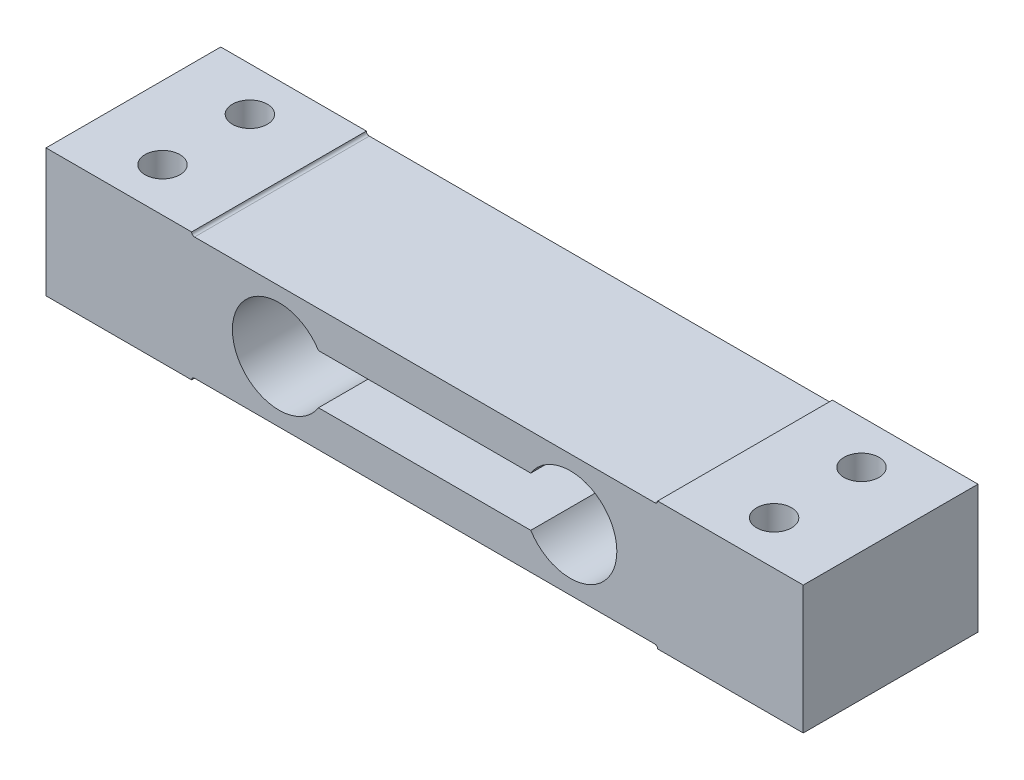
ISO-10303-21;
HEADER;
FILE_DESCRIPTION(('STEP AP214'),'2;1');
FILE_NAME('part.step','',(''),(''),'','','');
FILE_SCHEMA(('AUTOMOTIVE_DESIGN { 1 0 10303 214 1 1 1 1 }'));
ENDSEC;
DATA;
#1=APPLICATION_CONTEXT('core data for automotive mechanical design processes');
#2=APPLICATION_PROTOCOL_DEFINITION('international standard','automotive_design',2000,#1);
#3=PRODUCT_CONTEXT('',#1,'mechanical');
#4=PRODUCT('Part','Part','',(#3));
#5=PRODUCT_RELATED_PRODUCT_CATEGORY('part','',(#4));
#6=PRODUCT_DEFINITION_FORMATION('','',#4);
#7=PRODUCT_DEFINITION_CONTEXT('part definition',#1,'design');
#8=PRODUCT_DEFINITION('design','',#6,#7);
#9=PRODUCT_DEFINITION_SHAPE('','',#8);
#10=(LENGTH_UNIT() NAMED_UNIT(*) SI_UNIT(.MILLI.,.METRE.));
#11=(NAMED_UNIT(*) PLANE_ANGLE_UNIT() SI_UNIT($,.RADIAN.));
#12=(NAMED_UNIT(*) SI_UNIT($,.STERADIAN.) SOLID_ANGLE_UNIT());
#13=UNCERTAINTY_MEASURE_WITH_UNIT(LENGTH_MEASURE(1.E-05),#10,'distance_accuracy_value','');
#14=(GEOMETRIC_REPRESENTATION_CONTEXT(3) GLOBAL_UNCERTAINTY_ASSIGNED_CONTEXT((#13)) GLOBAL_UNIT_ASSIGNED_CONTEXT((#10,
#11,#12)) REPRESENTATION_CONTEXT('',''));
#15=CARTESIAN_POINT('',(0.,0.,0.));
#16=DIRECTION('',(0.,0.,1.));
#17=DIRECTION('',(1.,0.,0.));
#18=AXIS2_PLACEMENT_3D('',#15,#16,#17);
#19=CARTESIAN_POINT('',(-65.,11.,30.));
#20=DIRECTION('',(1.,0.,0.));
#21=DIRECTION('',(0.,0.,-1.));
#22=AXIS2_PLACEMENT_3D('',#19,#20,#21);
#23=PLANE('',#22);
#24=DIRECTION('',(0.,-1.,0.));
#25=VECTOR('',#24,1.);
#26=CARTESIAN_POINT('',(-65.,11.,0.));
#27=LINE('',#26,#25);
#28=CARTESIAN_POINT('',(-65.,11.,0.));
#29=VERTEX_POINT('',#28);
#30=CARTESIAN_POINT('',(-65.,-11.,0.));
#31=VERTEX_POINT('',#30);
#32=EDGE_CURVE('E217',#29,#31,#27,.T.);
#33=ORIENTED_EDGE('',*,*,#32,.T.);
#34=DIRECTION('',(0.,0.,-1.));
#35=VECTOR('',#34,1.);
#36=CARTESIAN_POINT('',(-65.,-11.,30.));
#37=LINE('',#36,#35);
#38=CARTESIAN_POINT('',(-65.,-11.,30.));
#39=VERTEX_POINT('',#38);
#40=EDGE_CURVE('E13',#39,#31,#37,.T.);
#41=ORIENTED_EDGE('',*,*,#40,.F.);
#42=DIRECTION('',(0.,-1.,0.));
#43=VECTOR('',#42,1.);
#44=CARTESIAN_POINT('',(-65.,11.,30.));
#45=LINE('',#44,#43);
#46=CARTESIAN_POINT('',(-65.,11.,30.));
#47=VERTEX_POINT('',#46);
#48=EDGE_CURVE('E218',#47,#39,#45,.T.);
#49=ORIENTED_EDGE('',*,*,#48,.F.);
#50=DIRECTION('',(0.,0.,-1.));
#51=VECTOR('',#50,1.);
#52=CARTESIAN_POINT('',(-65.,11.,30.));
#53=LINE('',#52,#51);
#54=EDGE_CURVE('E244',#47,#29,#53,.T.);
#55=ORIENTED_EDGE('',*,*,#54,.T.);
#56=EDGE_LOOP('',(#33,#41,#49,#55));
#57=FACE_BOUND('',#56,.T.);
#58=ADVANCED_FACE('F44',(#57),#23,.F.);
#59=CARTESIAN_POINT('',(-65.,-11.,30.));
#60=DIRECTION('',(0.,1.,0.));
#61=DIRECTION('',(-1.,0.,0.));
#62=AXIS2_PLACEMENT_3D('',#59,#60,#61);
#63=PLANE('',#62);
#64=CARTESIAN_POINT('',(-52.5,-11.,7.5));
#65=DIRECTION('',(0.,1.,0.));
#66=DIRECTION('',(-1.,0.,0.));
#67=AXIS2_PLACEMENT_3D('',#64,#65,#66);
#68=CIRCLE('',#67,3.);
#69=CARTESIAN_POINT('',(-55.5,-11.,7.5));
#70=VERTEX_POINT('',#69);
#71=EDGE_CURVE('E198',#70,#70,#68,.F.);
#72=ORIENTED_EDGE('',*,*,#71,.F.);
#73=EDGE_LOOP('',(#72));
#74=FACE_BOUND('',#73,.T.);
#75=CARTESIAN_POINT('',(-52.5,-11.,22.5));
#76=DIRECTION('',(0.,1.,0.));
#77=DIRECTION('',(-1.,0.,0.));
#78=AXIS2_PLACEMENT_3D('',#75,#76,#77);
#79=CIRCLE('',#78,3.);
#80=CARTESIAN_POINT('',(-55.5,-11.,22.5));
#81=VERTEX_POINT('',#80);
#82=EDGE_CURVE('E205',#81,#81,#79,.F.);
#83=ORIENTED_EDGE('',*,*,#82,.F.);
#84=EDGE_LOOP('',(#83));
#85=FACE_BOUND('',#84,.T.);
#86=DIRECTION('',(1.,0.,0.));
#87=VECTOR('',#86,1.);
#88=CARTESIAN_POINT('',(-65.,-11.,0.));
#89=LINE('',#88,#87);
#90=CARTESIAN_POINT('',(-40.,-11.,0.));
#91=VERTEX_POINT('',#90);
#92=EDGE_CURVE('E247',#31,#91,#89,.T.);
#93=ORIENTED_EDGE('',*,*,#92,.T.);
#94=DIRECTION('',(0.,0.,-1.));
#95=VECTOR('',#94,1.);
#96=CARTESIAN_POINT('',(-40.,-11.,30.));
#97=LINE('',#96,#95);
#98=CARTESIAN_POINT('',(-40.,-11.,30.));
#99=VERTEX_POINT('',#98);
#100=EDGE_CURVE('E51',#99,#91,#97,.T.);
#101=ORIENTED_EDGE('',*,*,#100,.F.);
#102=DIRECTION('',(1.,0.,0.));
#103=VECTOR('',#102,1.);
#104=CARTESIAN_POINT('',(-65.,-11.,30.));
#105=LINE('',#104,#103);
#106=EDGE_CURVE('E221',#39,#99,#105,.T.);
#107=ORIENTED_EDGE('',*,*,#106,.F.);
#108=ORIENTED_EDGE('',*,*,#40,.T.);
#109=EDGE_LOOP('',(#93,#101,#107,#108));
#110=FACE_BOUND('',#109,.T.);
#111=ADVANCED_FACE('F322',(#74,#85,#110),#63,.F.);
#112=CARTESIAN_POINT('',(-39.5,-11.,30.));
#113=DIRECTION('',(0.,0.,-1.));
#114=DIRECTION('',(-1.,0.,0.));
#115=AXIS2_PLACEMENT_3D('',#112,#113,#114);
#116=CYLINDRICAL_SURFACE('',#115,0.5);
#117=CARTESIAN_POINT('',(-39.5,-11.,0.));
#118=DIRECTION('',(0.,0.,-1.));
#119=DIRECTION('',(1.,0.,0.));
#120=AXIS2_PLACEMENT_3D('',#117,#118,#119);
#121=CIRCLE('',#120,0.5);
#122=CARTESIAN_POINT('',(-39.5,-10.5,0.));
#123=VERTEX_POINT('',#122);
#124=EDGE_CURVE('E249',#91,#123,#121,.T.);
#125=ORIENTED_EDGE('',*,*,#124,.T.);
#126=DIRECTION('',(0.,0.,-1.));
#127=VECTOR('',#126,1.);
#128=CARTESIAN_POINT('',(-39.5,-10.5,30.));
#129=LINE('',#128,#127);
#130=CARTESIAN_POINT('',(-39.5,-10.5,30.));
#131=VERTEX_POINT('',#130);
#132=EDGE_CURVE('E294',#131,#123,#129,.T.);
#133=ORIENTED_EDGE('',*,*,#132,.F.);
#134=CARTESIAN_POINT('',(-39.5,-11.,30.));
#135=DIRECTION('',(0.,0.,-1.));
#136=DIRECTION('',(1.,0.,0.));
#137=AXIS2_PLACEMENT_3D('',#134,#135,#136);
#138=CIRCLE('',#137,0.5);
#139=EDGE_CURVE('E224',#99,#131,#138,.T.);
#140=ORIENTED_EDGE('',*,*,#139,.F.);
#141=ORIENTED_EDGE('',*,*,#100,.T.);
#142=EDGE_LOOP('',(#125,#133,#140,#141));
#143=FACE_BOUND('',#142,.T.);
#144=ADVANCED_FACE('F301',(#143),#116,.F.);
#145=CARTESIAN_POINT('',(-39.5,-10.5,30.));
#146=DIRECTION('',(0.,1.,0.));
#147=DIRECTION('',(-1.,0.,0.));
#148=AXIS2_PLACEMENT_3D('',#145,#146,#147);
#149=PLANE('',#148);
#150=DIRECTION('',(1.,0.,0.));
#151=VECTOR('',#150,1.);
#152=CARTESIAN_POINT('',(-39.5,-10.5,0.));
#153=LINE('',#152,#151);
#154=CARTESIAN_POINT('',(39.5,-10.5,0.));
#155=VERTEX_POINT('',#154);
#156=EDGE_CURVE('E251',#123,#155,#153,.T.);
#157=ORIENTED_EDGE('',*,*,#156,.T.);
#158=DIRECTION('',(0.,0.,-1.));
#159=VECTOR('',#158,1.);
#160=CARTESIAN_POINT('',(39.5,-10.5,30.));
#161=LINE('',#160,#159);
#162=CARTESIAN_POINT('',(39.5,-10.5,30.));
#163=VERTEX_POINT('',#162);
#164=EDGE_CURVE('E291',#163,#155,#161,.T.);
#165=ORIENTED_EDGE('',*,*,#164,.F.);
#166=DIRECTION('',(1.,0.,0.));
#167=VECTOR('',#166,1.);
#168=CARTESIAN_POINT('',(-39.5,-10.5,30.));
#169=LINE('',#168,#167);
#170=EDGE_CURVE('E226',#131,#163,#169,.T.);
#171=ORIENTED_EDGE('',*,*,#170,.F.);
#172=ORIENTED_EDGE('',*,*,#132,.T.);
#173=EDGE_LOOP('',(#157,#165,#171,#172));
#174=FACE_BOUND('',#173,.T.);
#175=ADVANCED_FACE('F312',(#174),#149,.F.);
#176=CARTESIAN_POINT('',(39.5,-11.,30.));
#177=DIRECTION('',(0.,0.,-1.));
#178=DIRECTION('',(-1.,0.,0.));
#179=AXIS2_PLACEMENT_3D('',#176,#177,#178);
#180=CYLINDRICAL_SURFACE('',#179,0.499999999999999);
#181=CARTESIAN_POINT('',(39.5,-11.,0.));
#182=DIRECTION('',(0.,0.,-1.));
#183=DIRECTION('',(1.,0.,0.));
#184=AXIS2_PLACEMENT_3D('',#181,#182,#183);
#185=CIRCLE('',#184,0.499999999999999);
#186=CARTESIAN_POINT('',(40.,-11.,0.));
#187=VERTEX_POINT('',#186);
#188=EDGE_CURVE('E253',#155,#187,#185,.T.);
#189=ORIENTED_EDGE('',*,*,#188,.T.);
#190=DIRECTION('',(0.,0.,-1.));
#191=VECTOR('',#190,1.);
#192=CARTESIAN_POINT('',(40.,-11.,30.));
#193=LINE('',#192,#191);
#194=CARTESIAN_POINT('',(40.,-11.,30.));
#195=VERTEX_POINT('',#194);
#196=EDGE_CURVE('E288',#195,#187,#193,.T.);
#197=ORIENTED_EDGE('',*,*,#196,.F.);
#198=CARTESIAN_POINT('',(39.5,-11.,30.));
#199=DIRECTION('',(0.,0.,-1.));
#200=DIRECTION('',(1.,0.,0.));
#201=AXIS2_PLACEMENT_3D('',#198,#199,#200);
#202=CIRCLE('',#201,0.499999999999999);
#203=EDGE_CURVE('E228',#163,#195,#202,.T.);
#204=ORIENTED_EDGE('',*,*,#203,.F.);
#205=ORIENTED_EDGE('',*,*,#164,.T.);
#206=EDGE_LOOP('',(#189,#197,#204,#205));
#207=FACE_BOUND('',#206,.T.);
#208=ADVANCED_FACE('F316',(#207),#180,.F.);
#209=CARTESIAN_POINT('',(40.,-11.,30.));
#210=DIRECTION('',(0.,1.,0.));
#211=DIRECTION('',(0.,0.,1.));
#212=AXIS2_PLACEMENT_3D('',#209,#210,#211);
#213=PLANE('',#212);
#214=CARTESIAN_POINT('',(52.5,-11.,22.5));
#215=DIRECTION('',(0.,1.,0.));
#216=DIRECTION('',(-1.,0.,0.));
#217=AXIS2_PLACEMENT_3D('',#214,#215,#216);
#218=CIRCLE('',#217,3.);
#219=CARTESIAN_POINT('',(49.5,-11.,22.5));
#220=VERTEX_POINT('',#219);
#221=EDGE_CURVE('E197',#220,#220,#218,.F.);
#222=ORIENTED_EDGE('',*,*,#221,.F.);
#223=EDGE_LOOP('',(#222));
#224=FACE_BOUND('',#223,.T.);
#225=CARTESIAN_POINT('',(52.5,-11.,7.5));
#226=DIRECTION('',(0.,1.,0.));
#227=DIRECTION('',(-1.,0.,0.));
#228=AXIS2_PLACEMENT_3D('',#225,#226,#227);
#229=CIRCLE('',#228,3.);
#230=CARTESIAN_POINT('',(49.5,-11.,7.5));
#231=VERTEX_POINT('',#230);
#232=EDGE_CURVE('E214',#231,#231,#229,.F.);
#233=ORIENTED_EDGE('',*,*,#232,.F.);
#234=EDGE_LOOP('',(#233));
#235=FACE_BOUND('',#234,.T.);
#236=DIRECTION('',(1.,0.,0.));
#237=VECTOR('',#236,1.);
#238=CARTESIAN_POINT('',(40.,-11.,0.));
#239=LINE('',#238,#237);
#240=CARTESIAN_POINT('',(65.,-11.,0.));
#241=VERTEX_POINT('',#240);
#242=EDGE_CURVE('E255',#187,#241,#239,.T.);
#243=ORIENTED_EDGE('',*,*,#242,.T.);
#244=DIRECTION('',(0.,0.,-1.));
#245=VECTOR('',#244,1.);
#246=CARTESIAN_POINT('',(65.,-11.,30.));
#247=LINE('',#246,#245);
#248=CARTESIAN_POINT('',(65.,-11.,30.));
#249=VERTEX_POINT('',#248);
#250=EDGE_CURVE('E285',#249,#241,#247,.T.);
#251=ORIENTED_EDGE('',*,*,#250,.F.);
#252=DIRECTION('',(1.,0.,0.));
#253=VECTOR('',#252,1.);
#254=CARTESIAN_POINT('',(40.,-11.,30.));
#255=LINE('',#254,#253);
#256=EDGE_CURVE('E230',#195,#249,#255,.T.);
#257=ORIENTED_EDGE('',*,*,#256,.F.);
#258=ORIENTED_EDGE('',*,*,#196,.T.);
#259=EDGE_LOOP('',(#243,#251,#257,#258));
#260=FACE_BOUND('',#259,.T.);
#261=ADVANCED_FACE('F355',(#224,#235,#260),#213,.F.);
#262=CARTESIAN_POINT('',(65.,11.,30.));
#263=DIRECTION('',(-1.,0.,0.));
#264=DIRECTION('',(0.,0.,1.));
#265=AXIS2_PLACEMENT_3D('',#262,#263,#264);
#266=PLANE('',#265);
#267=DIRECTION('',(0.,1.,0.));
#268=VECTOR('',#267,1.);
#269=CARTESIAN_POINT('',(65.,11.,0.));
#270=LINE('',#269,#268);
#271=CARTESIAN_POINT('',(65.,11.,0.));
#272=VERTEX_POINT('',#271);
#273=EDGE_CURVE('E257',#241,#272,#270,.T.);
#274=ORIENTED_EDGE('',*,*,#273,.T.);
#275=DIRECTION('',(0.,0.,-1.));
#276=VECTOR('',#275,1.);
#277=CARTESIAN_POINT('',(65.,11.,30.));
#278=LINE('',#277,#276);
#279=CARTESIAN_POINT('',(65.,11.,30.));
#280=VERTEX_POINT('',#279);
#281=EDGE_CURVE('E282',#280,#272,#278,.T.);
#282=ORIENTED_EDGE('',*,*,#281,.F.);
#283=DIRECTION('',(0.,1.,0.));
#284=VECTOR('',#283,1.);
#285=CARTESIAN_POINT('',(65.,11.,30.));
#286=LINE('',#285,#284);
#287=EDGE_CURVE('E232',#249,#280,#286,.T.);
#288=ORIENTED_EDGE('',*,*,#287,.F.);
#289=ORIENTED_EDGE('',*,*,#250,.T.);
#290=EDGE_LOOP('',(#274,#282,#288,#289));
#291=FACE_BOUND('',#290,.T.);
#292=ADVANCED_FACE('F353',(#291),#266,.F.);
#293=CARTESIAN_POINT('',(40.,11.,30.));
#294=DIRECTION('',(0.,-1.,0.));
#295=DIRECTION('',(0.,0.,-1.));
#296=AXIS2_PLACEMENT_3D('',#293,#294,#295);
#297=PLANE('',#296);
#298=CARTESIAN_POINT('',(52.5,11.,22.5));
#299=DIRECTION('',(0.,1.,0.));
#300=DIRECTION('',(0.,0.,1.));
#301=AXIS2_PLACEMENT_3D('',#298,#299,#300);
#302=CIRCLE('',#301,3.);
#303=CARTESIAN_POINT('',(52.5,11.,25.5));
#304=VERTEX_POINT('',#303);
#305=EDGE_CURVE('E194',#304,#304,#302,.T.);
#306=ORIENTED_EDGE('',*,*,#305,.F.);
#307=EDGE_LOOP('',(#306));
#308=FACE_BOUND('',#307,.T.);
#309=CARTESIAN_POINT('',(52.5,11.,7.5));
#310=DIRECTION('',(0.,1.,0.));
#311=DIRECTION('',(0.,0.,1.));
#312=AXIS2_PLACEMENT_3D('',#309,#310,#311);
#313=CIRCLE('',#312,3.);
#314=CARTESIAN_POINT('',(52.5,11.,10.5));
#315=VERTEX_POINT('',#314);
#316=EDGE_CURVE('E201',#315,#315,#313,.T.);
#317=ORIENTED_EDGE('',*,*,#316,.F.);
#318=EDGE_LOOP('',(#317));
#319=FACE_BOUND('',#318,.T.);
#320=DIRECTION('',(-1.,0.,0.));
#321=VECTOR('',#320,1.);
#322=CARTESIAN_POINT('',(40.,11.,0.));
#323=LINE('',#322,#321);
#324=CARTESIAN_POINT('',(40.,11.,0.));
#325=VERTEX_POINT('',#324);
#326=EDGE_CURVE('E259',#272,#325,#323,.T.);
#327=ORIENTED_EDGE('',*,*,#326,.T.);
#328=DIRECTION('',(0.,0.,-1.));
#329=VECTOR('',#328,1.);
#330=CARTESIAN_POINT('',(40.,11.,30.));
#331=LINE('',#330,#329);
#332=CARTESIAN_POINT('',(40.,11.,30.));
#333=VERTEX_POINT('',#332);
#334=EDGE_CURVE('E279',#333,#325,#331,.T.);
#335=ORIENTED_EDGE('',*,*,#334,.F.);
#336=DIRECTION('',(-1.,0.,0.));
#337=VECTOR('',#336,1.);
#338=CARTESIAN_POINT('',(40.,11.,30.));
#339=LINE('',#338,#337);
#340=EDGE_CURVE('E234',#280,#333,#339,.T.);
#341=ORIENTED_EDGE('',*,*,#340,.F.);
#342=ORIENTED_EDGE('',*,*,#281,.T.);
#343=EDGE_LOOP('',(#327,#335,#341,#342));
#344=FACE_BOUND('',#343,.T.);
#345=ADVANCED_FACE('F349',(#308,#319,#344),#297,.F.);
#346=CARTESIAN_POINT('',(39.5,11.,30.));
#347=DIRECTION('',(0.,0.,-1.));
#348=DIRECTION('',(-1.,0.,0.));
#349=AXIS2_PLACEMENT_3D('',#346,#347,#348);
#350=CYLINDRICAL_SURFACE('',#349,0.5);
#351=CARTESIAN_POINT('',(39.5,11.,0.));
#352=DIRECTION('',(0.,0.,-1.));
#353=DIRECTION('',(1.,0.,0.));
#354=AXIS2_PLACEMENT_3D('',#351,#352,#353);
#355=CIRCLE('',#354,0.5);
#356=CARTESIAN_POINT('',(39.5,10.5,0.));
#357=VERTEX_POINT('',#356);
#358=EDGE_CURVE('E261',#325,#357,#355,.T.);
#359=ORIENTED_EDGE('',*,*,#358,.T.);
#360=DIRECTION('',(0.,0.,-1.));
#361=VECTOR('',#360,1.);
#362=CARTESIAN_POINT('',(39.5,10.5,30.));
#363=LINE('',#362,#361);
#364=CARTESIAN_POINT('',(39.5,10.5,30.));
#365=VERTEX_POINT('',#364);
#366=EDGE_CURVE('E276',#365,#357,#363,.T.);
#367=ORIENTED_EDGE('',*,*,#366,.F.);
#368=CARTESIAN_POINT('',(39.5,11.,30.));
#369=DIRECTION('',(0.,0.,-1.));
#370=DIRECTION('',(1.,0.,0.));
#371=AXIS2_PLACEMENT_3D('',#368,#369,#370);
#372=CIRCLE('',#371,0.5);
#373=EDGE_CURVE('E236',#333,#365,#372,.T.);
#374=ORIENTED_EDGE('',*,*,#373,.F.);
#375=ORIENTED_EDGE('',*,*,#334,.T.);
#376=EDGE_LOOP('',(#359,#367,#374,#375));
#377=FACE_BOUND('',#376,.T.);
#378=ADVANCED_FACE('F344',(#377),#350,.F.);
#379=CARTESIAN_POINT('',(-39.5,10.5,30.));
#380=DIRECTION('',(0.,-1.,0.));
#381=DIRECTION('',(1.,0.,0.));
#382=AXIS2_PLACEMENT_3D('',#379,#380,#381);
#383=PLANE('',#382);
#384=DIRECTION('',(-1.,0.,0.));
#385=VECTOR('',#384,1.);
#386=CARTESIAN_POINT('',(-39.5,10.5,0.));
#387=LINE('',#386,#385);
#388=CARTESIAN_POINT('',(-39.5,10.5,0.));
#389=VERTEX_POINT('',#388);
#390=EDGE_CURVE('E263',#357,#389,#387,.T.);
#391=ORIENTED_EDGE('',*,*,#390,.T.);
#392=DIRECTION('',(0.,0.,-1.));
#393=VECTOR('',#392,1.);
#394=CARTESIAN_POINT('',(-39.5,10.5,30.));
#395=LINE('',#394,#393);
#396=CARTESIAN_POINT('',(-39.5,10.5,30.));
#397=VERTEX_POINT('',#396);
#398=EDGE_CURVE('E273',#397,#389,#395,.T.);
#399=ORIENTED_EDGE('',*,*,#398,.F.);
#400=DIRECTION('',(-1.,0.,0.));
#401=VECTOR('',#400,1.);
#402=CARTESIAN_POINT('',(-39.5,10.5,30.));
#403=LINE('',#402,#401);
#404=EDGE_CURVE('E238',#365,#397,#403,.T.);
#405=ORIENTED_EDGE('',*,*,#404,.F.);
#406=ORIENTED_EDGE('',*,*,#366,.T.);
#407=EDGE_LOOP('',(#391,#399,#405,#406));
#408=FACE_BOUND('',#407,.T.);
#409=ADVANCED_FACE('F338',(#408),#383,.F.);
#410=CARTESIAN_POINT('',(-39.5,11.,30.));
#411=DIRECTION('',(0.,0.,-1.));
#412=DIRECTION('',(-1.,0.,0.));
#413=AXIS2_PLACEMENT_3D('',#410,#411,#412);
#414=CYLINDRICAL_SURFACE('',#413,0.5);
#415=CARTESIAN_POINT('',(-39.5,11.,0.));
#416=DIRECTION('',(0.,0.,-1.));
#417=DIRECTION('',(1.,0.,0.));
#418=AXIS2_PLACEMENT_3D('',#415,#416,#417);
#419=CIRCLE('',#418,0.5);
#420=CARTESIAN_POINT('',(-40.,11.,0.));
#421=VERTEX_POINT('',#420);
#422=EDGE_CURVE('E265',#389,#421,#419,.T.);
#423=ORIENTED_EDGE('',*,*,#422,.T.);
#424=DIRECTION('',(0.,0.,-1.));
#425=VECTOR('',#424,1.);
#426=CARTESIAN_POINT('',(-40.,11.,30.));
#427=LINE('',#426,#425);
#428=CARTESIAN_POINT('',(-40.,11.,30.));
#429=VERTEX_POINT('',#428);
#430=EDGE_CURVE('E270',#429,#421,#427,.T.);
#431=ORIENTED_EDGE('',*,*,#430,.F.);
#432=CARTESIAN_POINT('',(-39.5,11.,30.));
#433=DIRECTION('',(0.,0.,-1.));
#434=DIRECTION('',(1.,0.,0.));
#435=AXIS2_PLACEMENT_3D('',#432,#433,#434);
#436=CIRCLE('',#435,0.5);
#437=EDGE_CURVE('E240',#397,#429,#436,.T.);
#438=ORIENTED_EDGE('',*,*,#437,.F.);
#439=ORIENTED_EDGE('',*,*,#398,.T.);
#440=EDGE_LOOP('',(#423,#431,#438,#439));
#441=FACE_BOUND('',#440,.T.);
#442=ADVANCED_FACE('F334',(#441),#414,.F.);
#443=CARTESIAN_POINT('',(-65.,11.,30.));
#444=DIRECTION('',(0.,-1.,0.));
#445=DIRECTION('',(0.,0.,-1.));
#446=AXIS2_PLACEMENT_3D('',#443,#444,#445);
#447=PLANE('',#446);
#448=CARTESIAN_POINT('',(-52.5,11.,7.5));
#449=DIRECTION('',(0.,1.,0.));
#450=DIRECTION('',(0.,0.,1.));
#451=AXIS2_PLACEMENT_3D('',#448,#449,#450);
#452=CIRCLE('',#451,3.);
#453=CARTESIAN_POINT('',(-52.5,11.,10.5));
#454=VERTEX_POINT('',#453);
#455=EDGE_CURVE('E202',#454,#454,#452,.T.);
#456=ORIENTED_EDGE('',*,*,#455,.F.);
#457=EDGE_LOOP('',(#456));
#458=FACE_BOUND('',#457,.T.);
#459=CARTESIAN_POINT('',(-52.5,11.,22.5));
#460=DIRECTION('',(0.,1.,0.));
#461=DIRECTION('',(0.,0.,1.));
#462=AXIS2_PLACEMENT_3D('',#459,#460,#461);
#463=CIRCLE('',#462,3.);
#464=CARTESIAN_POINT('',(-52.5,11.,25.5));
#465=VERTEX_POINT('',#464);
#466=EDGE_CURVE('E193',#465,#465,#463,.T.);
#467=ORIENTED_EDGE('',*,*,#466,.F.);
#468=EDGE_LOOP('',(#467));
#469=FACE_BOUND('',#468,.T.);
#470=DIRECTION('',(-1.,0.,0.));
#471=VECTOR('',#470,1.);
#472=CARTESIAN_POINT('',(-65.,11.,0.));
#473=LINE('',#472,#471);
#474=EDGE_CURVE('E222',#421,#29,#473,.T.);
#475=ORIENTED_EDGE('',*,*,#474,.T.);
#476=ORIENTED_EDGE('',*,*,#54,.F.);
#477=DIRECTION('',(-1.,0.,0.));
#478=VECTOR('',#477,1.);
#479=CARTESIAN_POINT('',(-65.,11.,30.));
#480=LINE('',#479,#478);
#481=EDGE_CURVE('E242',#429,#47,#480,.T.);
#482=ORIENTED_EDGE('',*,*,#481,.F.);
#483=ORIENTED_EDGE('',*,*,#430,.T.);
#484=EDGE_LOOP('',(#475,#476,#482,#483));
#485=FACE_BOUND('',#484,.T.);
#486=ADVANCED_FACE('F329',(#458,#469,#485),#447,.F.);
#487=CARTESIAN_POINT('',(-39.5,-11.,30.));
#488=DIRECTION('',(0.,0.,1.));
#489=DIRECTION('',(1.,0.,0.));
#490=AXIS2_PLACEMENT_3D('',#487,#488,#489);
#491=PLANE('',#490);
#492=DIRECTION('',(-1.,0.,0.));
#493=VECTOR('',#492,1.);
#494=CARTESIAN_POINT('',(18.222279144137,-4.25,30.));
#495=LINE('',#494,#493);
#496=CARTESIAN_POINT('',(18.222279144137,-4.25,30.));
#497=VERTEX_POINT('',#496);
#498=CARTESIAN_POINT('',(-18.222279144137,-4.24999999999999,30.));
#499=VERTEX_POINT('',#498);
#500=EDGE_CURVE('E170',#497,#499,#495,.T.);
#501=ORIENTED_EDGE('',*,*,#500,.T.);
#502=CARTESIAN_POINT('',(-25.,0.,30.));
#503=DIRECTION('',(0.,0.,1.));
#504=DIRECTION('',(1.,0.,0.));
#505=AXIS2_PLACEMENT_3D('',#502,#503,#504);
#506=CIRCLE('',#505,8.);
#507=CARTESIAN_POINT('',(-18.222279144137,4.24999999999999,30.));
#508=VERTEX_POINT('',#507);
#509=EDGE_CURVE('E157',#499,#508,#506,.F.);
#510=ORIENTED_EDGE('',*,*,#509,.T.);
#511=DIRECTION('',(-1.,0.,0.));
#512=VECTOR('',#511,1.);
#513=CARTESIAN_POINT('',(18.222279144137,4.24999999999999,30.));
#514=LINE('',#513,#512);
#515=CARTESIAN_POINT('',(18.222279144137,4.24999999999999,30.));
#516=VERTEX_POINT('',#515);
#517=EDGE_CURVE('E187',#516,#508,#514,.T.);
#518=ORIENTED_EDGE('',*,*,#517,.F.);
#519=CARTESIAN_POINT('',(25.,0.,30.));
#520=DIRECTION('',(0.,0.,1.));
#521=DIRECTION('',(1.,0.,0.));
#522=AXIS2_PLACEMENT_3D('',#519,#520,#521);
#523=CIRCLE('',#522,8.);
#524=EDGE_CURVE('E178',#516,#497,#523,.F.);
#525=ORIENTED_EDGE('',*,*,#524,.T.);
#526=EDGE_LOOP('',(#501,#510,#518,#525));
#527=FACE_BOUND('',#526,.T.);
#528=ORIENTED_EDGE('',*,*,#48,.T.);
#529=ORIENTED_EDGE('',*,*,#106,.T.);
#530=ORIENTED_EDGE('',*,*,#139,.T.);
#531=ORIENTED_EDGE('',*,*,#170,.T.);
#532=ORIENTED_EDGE('',*,*,#203,.T.);
#533=ORIENTED_EDGE('',*,*,#256,.T.);
#534=ORIENTED_EDGE('',*,*,#287,.T.);
#535=ORIENTED_EDGE('',*,*,#340,.T.);
#536=ORIENTED_EDGE('',*,*,#373,.T.);
#537=ORIENTED_EDGE('',*,*,#404,.T.);
#538=ORIENTED_EDGE('',*,*,#437,.T.);
#539=ORIENTED_EDGE('',*,*,#481,.T.);
#540=EDGE_LOOP('',(#528,#529,#530,#531,#532,#533,#534,#535,#536,#537,#538,#539));
#541=FACE_BOUND('',#540,.T.);
#542=ADVANCED_FACE('F176',(#527,#541),#491,.T.);
#543=CARTESIAN_POINT('',(-39.5,-11.,0.));
#544=DIRECTION('',(0.,0.,1.));
#545=DIRECTION('',(1.,0.,0.));
#546=AXIS2_PLACEMENT_3D('',#543,#544,#545);
#547=PLANE('',#546);
#548=CARTESIAN_POINT('',(-25.,0.,0.));
#549=DIRECTION('',(0.,0.,-1.));
#550=DIRECTION('',(-1.,0.,0.));
#551=AXIS2_PLACEMENT_3D('',#548,#549,#550);
#552=CIRCLE('',#551,8.);
#553=CARTESIAN_POINT('',(-18.222279144137,-4.24999999999999,0.));
#554=VERTEX_POINT('',#553);
#555=CARTESIAN_POINT('',(-18.222279144137,4.24999999999999,0.));
#556=VERTEX_POINT('',#555);
#557=EDGE_CURVE('E179',#554,#556,#552,.T.);
#558=ORIENTED_EDGE('',*,*,#557,.F.);
#559=DIRECTION('',(-1.,0.,0.));
#560=VECTOR('',#559,1.);
#561=CARTESIAN_POINT('',(18.222279144137,-4.25,0.));
#562=LINE('',#561,#560);
#563=CARTESIAN_POINT('',(18.222279144137,-4.25,0.));
#564=VERTEX_POINT('',#563);
#565=EDGE_CURVE('E173',#564,#554,#562,.T.);
#566=ORIENTED_EDGE('',*,*,#565,.F.);
#567=CARTESIAN_POINT('',(25.,0.,0.));
#568=DIRECTION('',(0.,0.,-1.));
#569=DIRECTION('',(-1.,0.,0.));
#570=AXIS2_PLACEMENT_3D('',#567,#568,#569);
#571=CIRCLE('',#570,8.);
#572=CARTESIAN_POINT('',(18.222279144137,4.24999999999999,0.));
#573=VERTEX_POINT('',#572);
#574=EDGE_CURVE('E184',#573,#564,#571,.T.);
#575=ORIENTED_EDGE('',*,*,#574,.F.);
#576=DIRECTION('',(-1.,0.,0.));
#577=VECTOR('',#576,1.);
#578=CARTESIAN_POINT('',(18.222279144137,4.24999999999999,0.));
#579=LINE('',#578,#577);
#580=EDGE_CURVE('E66',#573,#556,#579,.T.);
#581=ORIENTED_EDGE('',*,*,#580,.T.);
#582=EDGE_LOOP('',(#558,#566,#575,#581));
#583=FACE_BOUND('',#582,.T.);
#584=ORIENTED_EDGE('',*,*,#32,.F.);
#585=ORIENTED_EDGE('',*,*,#474,.F.);
#586=ORIENTED_EDGE('',*,*,#422,.F.);
#587=ORIENTED_EDGE('',*,*,#390,.F.);
#588=ORIENTED_EDGE('',*,*,#358,.F.);
#589=ORIENTED_EDGE('',*,*,#326,.F.);
#590=ORIENTED_EDGE('',*,*,#273,.F.);
#591=ORIENTED_EDGE('',*,*,#242,.F.);
#592=ORIENTED_EDGE('',*,*,#188,.F.);
#593=ORIENTED_EDGE('',*,*,#156,.F.);
#594=ORIENTED_EDGE('',*,*,#124,.F.);
#595=ORIENTED_EDGE('',*,*,#92,.F.);
#596=EDGE_LOOP('',(#584,#585,#586,#587,#588,#589,#590,#591,#592,#593,#594,#595));
#597=FACE_BOUND('',#596,.T.);
#598=ADVANCED_FACE('F307',(#583,#597),#547,.F.);
#599=CARTESIAN_POINT('',(52.5,-19.4852813742386,7.5));
#600=DIRECTION('',(0.,1.,0.));
#601=DIRECTION('',(0.,0.,1.));
#602=AXIS2_PLACEMENT_3D('',#599,#600,#601);
#603=CYLINDRICAL_SURFACE('',#602,3.);
#604=ORIENTED_EDGE('',*,*,#232,.T.);
#605=EDGE_LOOP('',(#604));
#606=FACE_BOUND('',#605,.T.);
#607=ORIENTED_EDGE('',*,*,#316,.T.);
#608=EDGE_LOOP('',(#607));
#609=FACE_BOUND('',#608,.T.);
#610=ADVANCED_FACE('F453',(#606,#609),#603,.F.);
#611=CARTESIAN_POINT('',(-52.5,-19.4852813742386,22.5));
#612=DIRECTION('',(0.,1.,0.));
#613=DIRECTION('',(0.,0.,1.));
#614=AXIS2_PLACEMENT_3D('',#611,#612,#613);
#615=CYLINDRICAL_SURFACE('',#614,3.);
#616=ORIENTED_EDGE('',*,*,#82,.T.);
#617=EDGE_LOOP('',(#616));
#618=FACE_BOUND('',#617,.T.);
#619=ORIENTED_EDGE('',*,*,#466,.T.);
#620=EDGE_LOOP('',(#619));
#621=FACE_BOUND('',#620,.T.);
#622=ADVANCED_FACE('F458',(#618,#621),#615,.F.);
#623=CARTESIAN_POINT('',(-52.5,-19.4852813742386,7.5));
#624=DIRECTION('',(0.,1.,0.));
#625=DIRECTION('',(0.,0.,1.));
#626=AXIS2_PLACEMENT_3D('',#623,#624,#625);
#627=CYLINDRICAL_SURFACE('',#626,3.);
#628=ORIENTED_EDGE('',*,*,#71,.T.);
#629=EDGE_LOOP('',(#628));
#630=FACE_BOUND('',#629,.T.);
#631=ORIENTED_EDGE('',*,*,#455,.T.);
#632=EDGE_LOOP('',(#631));
#633=FACE_BOUND('',#632,.T.);
#634=ADVANCED_FACE('F470',(#630,#633),#627,.F.);
#635=CARTESIAN_POINT('',(52.5,-19.4852813742386,22.5));
#636=DIRECTION('',(0.,1.,0.));
#637=DIRECTION('',(0.,0.,1.));
#638=AXIS2_PLACEMENT_3D('',#635,#636,#637);
#639=CYLINDRICAL_SURFACE('',#638,3.);
#640=ORIENTED_EDGE('',*,*,#221,.T.);
#641=EDGE_LOOP('',(#640));
#642=FACE_BOUND('',#641,.T.);
#643=ORIENTED_EDGE('',*,*,#305,.T.);
#644=EDGE_LOOP('',(#643));
#645=FACE_BOUND('',#644,.T.);
#646=ADVANCED_FACE('F480',(#642,#645),#639,.F.);
#647=CARTESIAN_POINT('',(18.222279144137,-4.25,97.9117073853986));
#648=DIRECTION('',(0.,-1.,0.));
#649=DIRECTION('',(1.,0.,0.));
#650=AXIS2_PLACEMENT_3D('',#647,#648,#649);
#651=PLANE('',#650);
#652=DIRECTION('',(0.,0.,-1.));
#653=VECTOR('',#652,1.);
#654=CARTESIAN_POINT('',(18.222279144137,-4.25,97.9117073853986));
#655=LINE('',#654,#653);
#656=EDGE_CURVE('E58',#497,#564,#655,.T.);
#657=ORIENTED_EDGE('',*,*,#656,.T.);
#658=ORIENTED_EDGE('',*,*,#565,.T.);
#659=DIRECTION('',(0.,0.,-1.));
#660=VECTOR('',#659,1.);
#661=CARTESIAN_POINT('',(-18.222279144137,-4.24999999999999,97.9117073853986));
#662=LINE('',#661,#660);
#663=EDGE_CURVE('E161',#499,#554,#662,.T.);
#664=ORIENTED_EDGE('',*,*,#663,.F.);
#665=ORIENTED_EDGE('',*,*,#500,.F.);
#666=EDGE_LOOP('',(#657,#658,#664,#665));
#667=FACE_BOUND('',#666,.T.);
#668=ADVANCED_FACE('F169',(#667),#651,.F.);
#669=CARTESIAN_POINT('',(-25.,0.,97.9117073853986));
#670=DIRECTION('',(0.,0.,-1.));
#671=DIRECTION('',(-1.,0.,0.));
#672=AXIS2_PLACEMENT_3D('',#669,#670,#671);
#673=CYLINDRICAL_SURFACE('',#672,8.);
#674=ORIENTED_EDGE('',*,*,#663,.T.);
#675=ORIENTED_EDGE('',*,*,#557,.T.);
#676=DIRECTION('',(0.,0.,-1.));
#677=VECTOR('',#676,1.);
#678=CARTESIAN_POINT('',(-18.222279144137,4.24999999999999,97.9117073853986));
#679=LINE('',#678,#677);
#680=EDGE_CURVE('E163',#508,#556,#679,.T.);
#681=ORIENTED_EDGE('',*,*,#680,.F.);
#682=ORIENTED_EDGE('',*,*,#509,.F.);
#683=EDGE_LOOP('',(#674,#675,#681,#682));
#684=FACE_BOUND('',#683,.T.);
#685=ADVANCED_FACE('F159',(#684),#673,.F.);
#686=CARTESIAN_POINT('',(18.222279144137,4.24999999999999,97.9117073853986));
#687=DIRECTION('',(0.,-1.,0.));
#688=DIRECTION('',(0.,0.,-1.));
#689=AXIS2_PLACEMENT_3D('',#686,#687,#688);
#690=PLANE('',#689);
#691=ORIENTED_EDGE('',*,*,#517,.T.);
#692=ORIENTED_EDGE('',*,*,#680,.T.);
#693=ORIENTED_EDGE('',*,*,#580,.F.);
#694=DIRECTION('',(0.,0.,-1.));
#695=VECTOR('',#694,1.);
#696=CARTESIAN_POINT('',(18.222279144137,4.24999999999999,97.9117073853986));
#697=LINE('',#696,#695);
#698=EDGE_CURVE('E189',#516,#573,#697,.T.);
#699=ORIENTED_EDGE('',*,*,#698,.F.);
#700=EDGE_LOOP('',(#691,#692,#693,#699));
#701=FACE_BOUND('',#700,.T.);
#702=ADVANCED_FACE('F520',(#701),#690,.T.);
#703=CARTESIAN_POINT('',(25.,0.,97.9117073853986));
#704=DIRECTION('',(0.,0.,-1.));
#705=DIRECTION('',(-1.,0.,0.));
#706=AXIS2_PLACEMENT_3D('',#703,#704,#705);
#707=CYLINDRICAL_SURFACE('',#706,8.);
#708=ORIENTED_EDGE('',*,*,#698,.T.);
#709=ORIENTED_EDGE('',*,*,#574,.T.);
#710=ORIENTED_EDGE('',*,*,#656,.F.);
#711=ORIENTED_EDGE('',*,*,#524,.F.);
#712=EDGE_LOOP('',(#708,#709,#710,#711));
#713=FACE_BOUND('',#712,.T.);
#714=ADVANCED_FACE('F529',(#713),#707,.F.);
#715=CLOSED_SHELL('',(#58,#111,#144,#175,#208,#261,#292,#345,#378,#409,#442,#486,#542,#598,#610,
#622,#634,#646,#668,#685,#702,#714));
#716=MANIFOLD_SOLID_BREP('B2',#715);
#717=ADVANCED_BREP_SHAPE_REPRESENTATION('',(#18,#716),#14);
#718=SHAPE_DEFINITION_REPRESENTATION(#9,#717);
ENDSEC;
END-ISO-10303-21;
